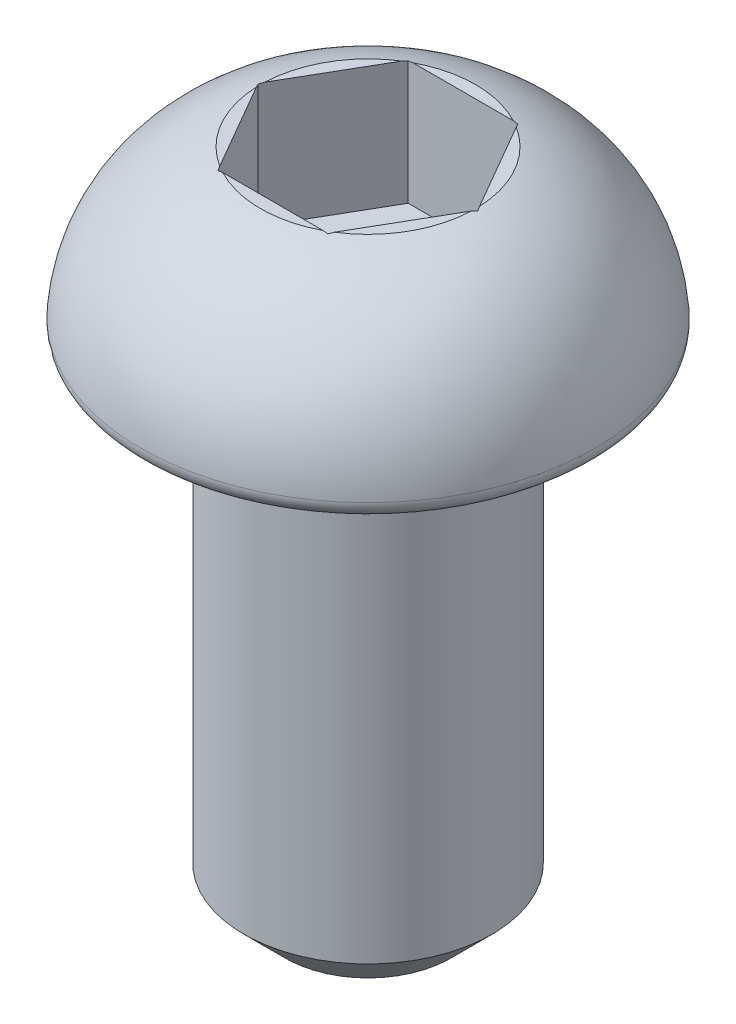
ISO-10303-21;
HEADER;
FILE_DESCRIPTION(('STEP AP214'),'2;1');
FILE_NAME('part.step','',(''),(''),'','','');
FILE_SCHEMA(('AUTOMOTIVE_DESIGN { 1 0 10303 214 1 1 1 1 }'));
ENDSEC;
DATA;
#1=APPLICATION_CONTEXT('core data for automotive mechanical design processes');
#2=APPLICATION_PROTOCOL_DEFINITION('international standard','automotive_design',2000,#1);
#3=PRODUCT_CONTEXT('',#1,'mechanical');
#4=PRODUCT('Part','Part','',(#3));
#5=PRODUCT_RELATED_PRODUCT_CATEGORY('part','',(#4));
#6=PRODUCT_DEFINITION_FORMATION('','',#4);
#7=PRODUCT_DEFINITION_CONTEXT('part definition',#1,'design');
#8=PRODUCT_DEFINITION('design','',#6,#7);
#9=PRODUCT_DEFINITION_SHAPE('','',#8);
#10=(LENGTH_UNIT() NAMED_UNIT(*) SI_UNIT(.MILLI.,.METRE.));
#11=(NAMED_UNIT(*) PLANE_ANGLE_UNIT() SI_UNIT($,.RADIAN.));
#12=(NAMED_UNIT(*) SI_UNIT($,.STERADIAN.) SOLID_ANGLE_UNIT());
#13=UNCERTAINTY_MEASURE_WITH_UNIT(LENGTH_MEASURE(1.E-05),#10,'distance_accuracy_value','');
#14=(GEOMETRIC_REPRESENTATION_CONTEXT(3) GLOBAL_UNCERTAINTY_ASSIGNED_CONTEXT((#13)) GLOBAL_UNIT_ASSIGNED_CONTEXT((#10,
#11,#12)) REPRESENTATION_CONTEXT('',''));
#15=CARTESIAN_POINT('',(0.,0.,0.));
#16=DIRECTION('',(0.,0.,1.));
#17=DIRECTION('',(1.,0.,0.));
#18=AXIS2_PLACEMENT_3D('',#15,#16,#17);
#19=CARTESIAN_POINT('',(0.,0.,0.));
#20=DIRECTION('',(0.,-1.,0.));
#21=DIRECTION('',(0.,0.,-1.));
#22=AXIS2_PLACEMENT_3D('',#19,#20,#21);
#23=PLANE('',#22);
#24=CARTESIAN_POINT('',(0.,0.,0.));
#25=DIRECTION('',(0.,-1.,0.));
#26=DIRECTION('',(0.,0.,-1.));
#27=AXIS2_PLACEMENT_3D('',#24,#25,#26);
#28=CIRCLE('',#27,2.54724235554234);
#29=CARTESIAN_POINT('',(0.,0.,-2.54724235554234));
#30=VERTEX_POINT('',#29);
#31=EDGE_CURVE('E188',#30,#30,#28,.T.);
#32=ORIENTED_EDGE('',*,*,#31,.T.);
#33=EDGE_LOOP('',(#32));
#34=FACE_BOUND('',#33,.T.);
#35=CARTESIAN_POINT('',(0.,0.,0.));
#36=DIRECTION('',(0.,-1.,0.));
#37=DIRECTION('',(0.,0.,-1.));
#38=AXIS2_PLACEMENT_3D('',#35,#36,#37);
#39=CIRCLE('',#38,1.5);
#40=CARTESIAN_POINT('',(0.,0.,-1.5));
#41=VERTEX_POINT('',#40);
#42=EDGE_CURVE('E154',#41,#41,#39,.T.);
#43=ORIENTED_EDGE('',*,*,#42,.F.);
#44=EDGE_LOOP('',(#43));
#45=FACE_BOUND('',#44,.T.);
#46=ADVANCED_FACE('F36',(#34,#45),#23,.T.);
#47=CARTESIAN_POINT('',(0.,2.,0.));
#48=DIRECTION('',(0.,1.,0.));
#49=DIRECTION('',(0.,0.,1.));
#50=AXIS2_PLACEMENT_3D('',#47,#48,#49);
#51=PLANE('',#50);
#52=DIRECTION('',(0.5,0.,-0.866025403784439));
#53=VECTOR('',#52,1.);
#54=CARTESIAN_POINT('',(0.66395280956807,2.,1.15));
#55=LINE('',#54,#53);
#56=CARTESIAN_POINT('',(0.692820323027552,2.,1.1));
#57=VERTEX_POINT('',#56);
#58=CARTESIAN_POINT('',(1.29903810567666,2.,0.0499999999999994));
#59=VERTEX_POINT('',#58);
#60=EDGE_CURVE('E163',#57,#59,#55,.T.);
#61=ORIENTED_EDGE('',*,*,#60,.F.);
#62=CARTESIAN_POINT('',(0.,2.,0.));
#63=DIRECTION('',(0.,-1.,0.));
#64=DIRECTION('',(0.,0.,-1.));
#65=AXIS2_PLACEMENT_3D('',#62,#63,#64);
#66=CIRCLE('',#65,1.3);
#67=EDGE_CURVE('E316',#59,#57,#66,.T.);
#68=ORIENTED_EDGE('',*,*,#67,.F.);
#69=EDGE_LOOP('',(#61,#68));
#70=FACE_BOUND('',#69,.T.);
#71=ADVANCED_FACE('F284',(#70),#51,.T.);
#72=DIRECTION('',(1.,0.,0.));
#73=VECTOR('',#72,1.);
#74=CARTESIAN_POINT('',(-0.66395280956807,2.,1.15));
#75=LINE('',#74,#73);
#76=CARTESIAN_POINT('',(-0.606217782649107,2.,1.15));
#77=VERTEX_POINT('',#76);
#78=CARTESIAN_POINT('',(0.606217782649107,2.,1.15));
#79=VERTEX_POINT('',#78);
#80=EDGE_CURVE('E149',#77,#79,#75,.T.);
#81=ORIENTED_EDGE('',*,*,#80,.F.);
#82=EDGE_CURVE('E318',#79,#77,#66,.T.);
#83=ORIENTED_EDGE('',*,*,#82,.F.);
#84=EDGE_LOOP('',(#81,#83));
#85=FACE_BOUND('',#84,.T.);
#86=ADVANCED_FACE('F290',(#85),#51,.T.);
#87=DIRECTION('',(0.5,0.,0.866025403784438));
#88=VECTOR('',#87,1.);
#89=CARTESIAN_POINT('',(-1.32790561913614,2.,0.));
#90=LINE('',#89,#88);
#91=CARTESIAN_POINT('',(-1.29903810567666,2.,0.0500000000000002));
#92=VERTEX_POINT('',#91);
#93=CARTESIAN_POINT('',(-0.692820323027551,2.,1.1));
#94=VERTEX_POINT('',#93);
#95=EDGE_CURVE('E151',#92,#94,#90,.T.);
#96=ORIENTED_EDGE('',*,*,#95,.F.);
#97=EDGE_CURVE('E320',#94,#92,#66,.T.);
#98=ORIENTED_EDGE('',*,*,#97,.F.);
#99=EDGE_LOOP('',(#96,#98));
#100=FACE_BOUND('',#99,.T.);
#101=ADVANCED_FACE('F344',(#100),#51,.T.);
#102=DIRECTION('',(-0.5,0.,0.866025403784439));
#103=VECTOR('',#102,1.);
#104=CARTESIAN_POINT('',(-0.66395280956807,2.,-1.15));
#105=LINE('',#104,#103);
#106=CARTESIAN_POINT('',(-0.692820323027551,2.,-1.1));
#107=VERTEX_POINT('',#106);
#108=CARTESIAN_POINT('',(-1.29903810567666,2.,-0.0500000000000003));
#109=VERTEX_POINT('',#108);
#110=EDGE_CURVE('E168',#107,#109,#105,.T.);
#111=ORIENTED_EDGE('',*,*,#110,.F.);
#112=EDGE_CURVE('E186',#109,#107,#66,.T.);
#113=ORIENTED_EDGE('',*,*,#112,.F.);
#114=EDGE_LOOP('',(#111,#113));
#115=FACE_BOUND('',#114,.T.);
#116=ADVANCED_FACE('F333',(#115),#51,.T.);
#117=DIRECTION('',(-1.,0.,0.));
#118=VECTOR('',#117,1.);
#119=CARTESIAN_POINT('',(0.663952809568069,2.,-1.15));
#120=LINE('',#119,#118);
#121=CARTESIAN_POINT('',(0.606217782649107,2.,-1.15));
#122=VERTEX_POINT('',#121);
#123=CARTESIAN_POINT('',(-0.606217782649107,2.,-1.15));
#124=VERTEX_POINT('',#123);
#125=EDGE_CURVE('E166',#122,#124,#120,.T.);
#126=ORIENTED_EDGE('',*,*,#125,.F.);
#127=EDGE_CURVE('E173',#124,#122,#66,.T.);
#128=ORIENTED_EDGE('',*,*,#127,.F.);
#129=EDGE_LOOP('',(#126,#128));
#130=FACE_BOUND('',#129,.T.);
#131=ADVANCED_FACE('F309',(#130),#51,.T.);
#132=DIRECTION('',(-0.5,0.,-0.866025403784438));
#133=VECTOR('',#132,1.);
#134=CARTESIAN_POINT('',(1.32790561913614,2.,0.));
#135=LINE('',#134,#133);
#136=CARTESIAN_POINT('',(1.29903810567666,2.,-0.0499999999999994));
#137=VERTEX_POINT('',#136);
#138=CARTESIAN_POINT('',(0.69282032302755,2.,-1.1));
#139=VERTEX_POINT('',#138);
#140=EDGE_CURVE('E51',#137,#139,#135,.T.);
#141=ORIENTED_EDGE('',*,*,#140,.F.);
#142=EDGE_CURVE('E187',#139,#137,#66,.T.);
#143=ORIENTED_EDGE('',*,*,#142,.F.);
#144=EDGE_LOOP('',(#141,#143));
#145=FACE_BOUND('',#144,.T.);
#146=ADVANCED_FACE('F292',(#145),#51,.T.);
#147=CARTESIAN_POINT('',(0.,0.076691427643514,0.));
#148=DIRECTION('',(0.,-1.,0.));
#149=DIRECTION('',(0.,0.,-1.));
#150=AXIS2_PLACEMENT_3D('',#147,#148,#149);
#151=DEGENERATE_TOROIDAL_SURFACE('',#150,0.751470934680709,2.,.T.);
#152=CARTESIAN_POINT('',(0.663837339514232,1.99178669993929,1.1502));
#153=CARTESIAN_POINT('',(0.66878717333089,1.99327644137946,1.14162663634053));
#154=CARTESIAN_POINT('',(0.673740102582228,1.99472242054365,1.13304791123091));
#155=CARTESIAN_POINT('',(0.683652150360132,1.99752685386907,1.11587974087253));
#156=CARTESIAN_POINT('',(0.688611268884708,1.99888530805844,1.10729029562721));
#157=CARTESIAN_POINT('',(0.693573482841972,2.0002,1.0986954889352));
#158=B_SPLINE_CURVE_WITH_KNOTS('',3,(#152,#153,#154,#155,#156,#157),.UNSPECIFIED.,.F.,.F.,(4,2,
4),(0.,0.0300325156416312,0.0600650216231519),.UNSPECIFIED.);
#159=CARTESIAN_POINT('',(0.66395280956807,1.99182146358279,1.15));
#160=VERTEX_POINT('',#159);
#161=EDGE_CURVE('E266',#160,#57,#158,.T.);
#162=ORIENTED_EDGE('',*,*,#161,.F.);
#163=CARTESIAN_POINT('',(0.,2.03658290017349,1.15));
#164=CARTESIAN_POINT('',(0.098646218600147,2.03658732143362,1.15));
#165=CARTESIAN_POINT('',(0.197295101956486,2.03408796152423,1.15));
#166=CARTESIAN_POINT('',(0.394304837949951,2.02310682474313,1.15));
#167=CARTESIAN_POINT('',(0.492665658489158,2.01462440489486,1.15));
#168=CARTESIAN_POINT('',(0.687609728686378,1.98957726871187,1.15));
#169=CARTESIAN_POINT('',(0.784200929312974,1.97307885273518,1.15));
#170=CARTESIAN_POINT('',(0.975057818596466,1.93000622100407,1.15));
#171=CARTESIAN_POINT('',(1.06932598789786,1.90344329758489,1.15));
#172=CARTESIAN_POINT('',(1.27000942224647,1.83324426296719,1.15));
#173=CARTESIAN_POINT('',(1.37568972004873,1.78744372549576,1.15));
#174=CARTESIAN_POINT('',(1.57845042818664,1.67924757225634,1.15));
#175=CARTESIAN_POINT('',(1.67551966120083,1.61683079666585,1.15));
#176=CARTESIAN_POINT('',(1.8578430964694,1.47582375887711,1.15));
#177=CARTESIAN_POINT('',(1.94304549944359,1.39716609459964,1.15));
#178=CARTESIAN_POINT('',(2.09784101718846,1.22574174763031,1.15));
#179=CARTESIAN_POINT('',(2.16743940990664,1.13297985346576,1.15));
#180=CARTESIAN_POINT('',(2.28431419983866,0.94263887552125,1.15));
#181=CARTESIAN_POINT('',(2.33275383814089,0.845772961604736,1.15));
#182=CARTESIAN_POINT('',(2.41188684890319,0.645049587695764,1.15));
#183=CARTESIAN_POINT('',(2.44258507109003,0.541194047036149,1.15));
#184=CARTESIAN_POINT('',(2.48427081779776,0.334046404725987,1.15));
#185=CARTESIAN_POINT('',(2.49601517014892,0.230905918770504,1.15));
#186=CARTESIAN_POINT('',(2.50179966751879,0.0241281883602649,1.15));
#187=CARTESIAN_POINT('',(2.49584075628937,-0.0795090293199227,1.15));
#188=CARTESIAN_POINT('',(2.46658780707738,-0.283077440217687,1.15));
#189=CARTESIAN_POINT('',(2.44349452160948,-0.383037592772008,1.15));
#190=CARTESIAN_POINT('',(2.38096161026423,-0.577676291567684,1.15));
#191=CARTESIAN_POINT('',(2.34152541798826,-0.672355942490544,1.15));
#192=CARTESIAN_POINT('',(2.24727327907491,-0.854473591721951,1.15));
#193=CARTESIAN_POINT('',(2.19236137755517,-0.941861853863798,1.15));
#194=CARTESIAN_POINT('',(2.06898309304621,-1.10654284237712,1.15));
#195=CARTESIAN_POINT('',(2.00050758110401,-1.18382871088677,1.15));
#196=CARTESIAN_POINT('',(1.85001098526993,-1.32858936571327,1.15));
#197=CARTESIAN_POINT('',(1.76765450591879,-1.3957143916501,1.15));
#198=CARTESIAN_POINT('',(1.59361449911652,-1.51612024156412,1.15));
#199=CARTESIAN_POINT('',(1.50194689329583,-1.56942416234802,1.15));
#200=CARTESIAN_POINT('',(1.3442167468046,-1.64633505265362,1.15));
#201=CARTESIAN_POINT('',(1.28002488900966,-1.67388067349761,1.15));
#202=CARTESIAN_POINT('',(1.14942569560088,-1.72309655156327,1.15));
#203=CARTESIAN_POINT('',(1.08301829059227,-1.74476662455823,1.15));
#204=CARTESIAN_POINT('',(0.948299721594118,-1.78271208504272,1.15));
#205=CARTESIAN_POINT('',(0.879979992399287,-1.79895664735316,1.15));
#206=CARTESIAN_POINT('',(0.742372225887791,-1.82648676897236,1.15));
#207=CARTESIAN_POINT('',(0.673084213384437,-1.83777245511816,1.15));
#208=CARTESIAN_POINT('',(0.491428640373657,-1.8618030535964,1.15));
#209=CARTESIAN_POINT('',(0.378625107961637,-1.87122074908676,1.15));
#210=CARTESIAN_POINT('',(0.209143758579499,-1.87958699044929,1.15));
#211=CARTESIAN_POINT('',(0.152562345228347,-1.88141490888953,1.15));
#212=CARTESIAN_POINT('',(0.0393669602172776,-1.88335114487218,1.15));
#213=CARTESIAN_POINT('',(-0.0172470100143041,-1.883459532838,1.15));
#214=CARTESIAN_POINT('',(-0.130350030932136,-1.88197557574409,1.15));
#215=CARTESIAN_POINT('',(-0.186839119823327,-1.88038635915171,1.15));
#216=CARTESIAN_POINT('',(-0.299728920798325,-1.87531771771226,1.15));
#217=CARTESIAN_POINT('',(-0.356129628836693,-1.87183820873768,1.15));
#218=CARTESIAN_POINT('',(-0.524916952582429,-1.85805049067533,1.15));
#219=CARTESIAN_POINT('',(-0.637092371817397,-1.84439266677423,1.15));
#220=CARTESIAN_POINT('',(-0.810017493876797,-1.81361696288777,1.15));
#221=CARTESIAN_POINT('',(-0.871521077506692,-1.80071656706703,1.15));
#222=CARTESIAN_POINT('',(-0.993496408589721,-1.77064052799502,1.15));
#223=CARTESIAN_POINT('',(-1.05396806098029,-1.75346449311514,1.15));
#224=CARTESIAN_POINT('',(-1.17323439190626,-1.71454198802947,1.15));
#225=CARTESIAN_POINT('',(-1.2320335047974,-1.69280919801169,1.15));
#226=CARTESIAN_POINT('',(-1.34764514507638,-1.64452542038476,1.15));
#227=CARTESIAN_POINT('',(-1.40445721463237,-1.61797333097724,1.15));
#228=CARTESIAN_POINT('',(-1.51607405614635,-1.55969669663654,1.15));
#229=CARTESIAN_POINT('',(-1.57085410804412,-1.52792462132762,1.15));
#230=CARTESIAN_POINT('',(-1.67726545993891,-1.45943403628238,1.15));
#231=CARTESIAN_POINT('',(-1.72889554802264,-1.42271363995312,1.15));
#232=CARTESIAN_POINT('',(-1.82847105838098,-1.34445894230347,1.15));
#233=CARTESIAN_POINT('',(-1.87641252573548,-1.30291959053453,1.15));
#234=CARTESIAN_POINT('',(-1.9680035552563,-1.21534492943057,1.15));
#235=CARTESIAN_POINT('',(-2.01165174969555,-1.16930819659477,1.15));
#236=CARTESIAN_POINT('',(-2.12614975655006,-1.03572622565891,1.15));
#237=CARTESIAN_POINT('',(-2.19186050387076,-0.943665750390142,1.15));
#238=CARTESIAN_POINT('',(-2.30546191326039,-0.749288259753581,1.15));
#239=CARTESIAN_POINT('',(-2.35337031200657,-0.646981582540756,1.15));
#240=CARTESIAN_POINT('',(-2.42703869947872,-0.442585671523526,1.15));
#241=CARTESIAN_POINT('',(-2.45409068083514,-0.340961259178402,1.15));
#242=CARTESIAN_POINT('',(-2.49032992545249,-0.134567326214733,1.15));
#243=CARTESIAN_POINT('',(-2.49951787124879,-0.0297979259127926,1.15));
#244=CARTESIAN_POINT('',(-2.49971519023315,0.177457556639515,1.15));
#245=CARTESIAN_POINT('',(-2.49111740474565,0.279943506757529,1.15));
#246=CARTESIAN_POINT('',(-2.45681698932696,0.482000924000085,1.15));
#247=CARTESIAN_POINT('',(-2.43111591392285,0.581572655140941,1.15));
#248=CARTESIAN_POINT('',(-2.36347334234934,0.774935615001325,1.15));
#249=CARTESIAN_POINT('',(-2.32154526289618,0.868731545166596,1.15));
#250=CARTESIAN_POINT('',(-2.22279701257776,1.04811167401887,1.15));
#251=CARTESIAN_POINT('',(-2.16597630912103,1.13369557887707,1.15));
#252=CARTESIAN_POINT('',(-2.03810854833738,1.29594922041055,1.15));
#253=CARTESIAN_POINT('',(-1.96682676359936,1.37243365695663,1.15));
#254=CARTESIAN_POINT('',(-1.81295905623226,1.51300240336353,1.15));
#255=CARTESIAN_POINT('',(-1.73037090646585,1.57708426413665,1.15));
#256=CARTESIAN_POINT('',(-1.5520613820707,1.69471516717586,1.15));
#257=CARTESIAN_POINT('',(-1.45589046579648,1.74757961403836,1.15));
#258=CARTESIAN_POINT('',(-1.25692243260643,1.83837035879711,1.15));
#259=CARTESIAN_POINT('',(-1.15413109373742,1.87630948273586,1.15));
#260=CARTESIAN_POINT('',(-0.964938329481516,1.93242013134816,1.15));
#261=CARTESIAN_POINT('',(-0.879225780531216,1.95299866436732,1.15));
#262=CARTESIAN_POINT('',(-0.706280939870257,1.98646029403696,1.15));
#263=CARTESIAN_POINT('',(-0.6190475593282,1.9993376228744,1.15));
#264=CARTESIAN_POINT('',(-0.443289273005161,2.01901301040914,1.15));
#265=CARTESIAN_POINT('',(-0.354759586940948,2.02576557714995,1.15));
#266=CARTESIAN_POINT('',(-0.17748732142704,2.03454856601354,1.15));
#267=CARTESIAN_POINT('',(-0.0887447390438819,2.03657892269132,1.15));
#268=CARTESIAN_POINT('',(0.,2.03658290017349,1.15));
#269=B_SPLINE_CURVE_WITH_KNOTS('',3,(#163,#164,#165,#166,#167,#168,#169,#170,#171,#172,#173,
#174,#175,#176,#177,#178,#179,#180,#181,#182,#183,#184,#185,#186,#187,#188,#189,#190,#191,#192,
#193,#194,#195,#196,#197,#198,#199,#200,#201,#202,#203,#204,#205,#206,#207,#208,#209,#210,#211,
#212,#213,#214,#215,#216,#217,#218,#219,#220,#221,#222,#223,#224,#225,#226,#227,#228,#229,#230,
#231,#232,#233,#234,#235,#236,#237,#238,#239,#240,#241,#242,#243,#244,#245,#246,#247,#248,#249,
#250,#251,#252,#253,#254,#255,#256,#257,#258,#259,#260,#261,#262,#263,#264,#265,#266,#267,#268),
.UNSPECIFIED.,.T.,.F.,(4,2,2,2,2,2,2,2,2,2,2,2,2,2,2,2,2,2,2,2,2,2,2,2,2,2,2,2,2,2,2,2,2,2,2,2,
2,2,2,2,2,2,2,2,2,2,2,2,2,2,2,2,4),(0.,0.295902440396797,0.591836685142885,0.88536388192649,
1.1785627130153,1.52269996813138,1.86727757612131,2.21331506104864,2.5592353240376,
2.88250449229488,3.2056852510601,3.51561009227793,3.82551841185847,4.13185195746594,
4.43812117581053,4.74633280791623,5.05475259026988,5.37212175852073,5.68895709402482,
5.89824437929793,6.10753822597639,6.31800171851667,6.52845982755554,6.86760372007158,
7.03742508416335,7.20723949320035,7.37674149510497,7.54625104131724,7.8846605033158,
8.07306010337971,8.26147696632307,8.44933606655962,8.63723816976182,8.82695710833894,
9.01674858473973,9.20674079803173,9.39679334327464,9.73415597564318,10.0711815829047,
10.3851290507443,10.6990645232839,11.0061400458043,11.3131876618792,11.6199819471461,
11.9267872055172,12.2390410643218,12.5513565198947,12.8792462443636,13.2068535787986,
13.4709069754266,13.7351578878529,14.0013558354432,14.267557472243),.UNSPECIFIED.);
#270=EDGE_CURVE('E59',#79,#160,#269,.T.);
#271=ORIENTED_EDGE('',*,*,#270,.F.);
#272=ORIENTED_EDGE('',*,*,#82,.T.);
#273=CARTESIAN_POINT('',(-0.66395280956807,1.99182146358212,1.15));
#274=VERTEX_POINT('',#273);
#275=EDGE_CURVE('E262',#274,#77,#269,.T.);
#276=ORIENTED_EDGE('',*,*,#275,.F.);
#277=CARTESIAN_POINT('',(-0.693573482841972,2.0002,1.0986954889352));
#278=CARTESIAN_POINT('',(-0.688611268884708,1.99888530805844,1.10729029562721));
#279=CARTESIAN_POINT('',(-0.683652150360132,1.99752685386907,1.11587974087253));
#280=CARTESIAN_POINT('',(-0.673740102582228,1.99472242054365,1.13304791123091));
#281=CARTESIAN_POINT('',(-0.66878717333089,1.99327644137946,1.14162663634053));
#282=CARTESIAN_POINT('',(-0.663837339514232,1.99178669993929,1.1502));
#283=B_SPLINE_CURVE_WITH_KNOTS('',3,(#277,#278,#279,#280,#281,#282),.UNSPECIFIED.,.F.,.F.,(4,2,
4),(0.,0.0300325059815209,0.0600650216231522),.UNSPECIFIED.);
#284=EDGE_CURVE('E257',#94,#274,#283,.T.);
#285=ORIENTED_EDGE('',*,*,#284,.F.);
#286=ORIENTED_EDGE('',*,*,#97,.T.);
#287=CARTESIAN_POINT('',(-1.32802108918998,1.99178669993929,-0.000199999999999881));
#288=CARTESIAN_POINT('',(-1.32307125537332,1.99327644137946,0.00837336365947469));
#289=CARTESIAN_POINT('',(-1.31811832612198,1.99472242054365,0.0169520887690861));
#290=CARTESIAN_POINT('',(-1.30820627834408,1.99752685386907,0.0341202591274678));
#291=CARTESIAN_POINT('',(-1.3032471598195,1.99888530805844,0.0427097043727891));
#292=CARTESIAN_POINT('',(-1.29828494586224,2.0002,0.0513045110647981));
#293=B_SPLINE_CURVE_WITH_KNOTS('',3,(#287,#288,#289,#290,#291,#292),.UNSPECIFIED.,.F.,.F.,(4,2,
4),(0.,0.030032515641632,0.0600650216231535),.UNSPECIFIED.);
#294=CARTESIAN_POINT('',(-1.32790561913614,1.99182146358212,0.));
#295=VERTEX_POINT('',#294);
#296=EDGE_CURVE('E252',#295,#92,#293,.T.);
#297=ORIENTED_EDGE('',*,*,#296,.F.);
#298=CARTESIAN_POINT('',(-1.29828494586224,2.0002,-0.0513045110647978));
#299=CARTESIAN_POINT('',(-1.3032471598195,1.99888530805844,-0.0427097043727888));
#300=CARTESIAN_POINT('',(-1.30820627834408,1.99752685386907,-0.0341202591274676));
#301=CARTESIAN_POINT('',(-1.31811832612198,1.99472242054365,-0.016952088769086));
#302=CARTESIAN_POINT('',(-1.32307125537332,1.99327644137946,-0.00837336365947457));
#303=CARTESIAN_POINT('',(-1.32802108918998,1.99178669993929,0.000199999999999972));
#304=B_SPLINE_CURVE_WITH_KNOTS('',3,(#298,#299,#300,#301,#302,#303),.UNSPECIFIED.,.F.,.F.,(4,2,
4),(0.,0.0300325059815215,0.0600650216231534),.UNSPECIFIED.);
#305=EDGE_CURVE('E232',#109,#295,#304,.T.);
#306=ORIENTED_EDGE('',*,*,#305,.F.);
#307=ORIENTED_EDGE('',*,*,#112,.T.);
#308=CARTESIAN_POINT('',(-0.663837339514232,1.99178669993929,-1.1502));
#309=CARTESIAN_POINT('',(-0.66878717333089,1.99327644137946,-1.14162663634053));
#310=CARTESIAN_POINT('',(-0.673740102582228,1.99472242054365,-1.13304791123091));
#311=CARTESIAN_POINT('',(-0.683652150360133,1.99752685386907,-1.11587974087253));
#312=CARTESIAN_POINT('',(-0.688611268884709,1.99888530805844,-1.10729029562721));
#313=CARTESIAN_POINT('',(-0.693573482841973,2.0002,-1.0986954889352));
#314=B_SPLINE_CURVE_WITH_KNOTS('',3,(#308,#309,#310,#311,#312,#313),.UNSPECIFIED.,.F.,.F.,(4,2,
4),(0.,0.0300325156416316,0.0600650216231527),.UNSPECIFIED.);
#315=CARTESIAN_POINT('',(-0.66395280956807,1.99182146358279,-1.15));
#316=VERTEX_POINT('',#315);
#317=EDGE_CURVE('E227',#316,#107,#314,.T.);
#318=ORIENTED_EDGE('',*,*,#317,.F.);
#319=CARTESIAN_POINT('',(0.,2.03658290017349,-1.15));
#320=CARTESIAN_POINT('',(-0.0986462186001475,2.03658732143362,-1.15));
#321=CARTESIAN_POINT('',(-0.197295101956487,2.03408796152423,-1.15));
#322=CARTESIAN_POINT('',(-0.394304837949951,2.02310682474313,-1.15));
#323=CARTESIAN_POINT('',(-0.492665658489158,2.01462440489486,-1.15));
#324=CARTESIAN_POINT('',(-0.687609728686379,1.98957726871187,-1.15));
#325=CARTESIAN_POINT('',(-0.784200929312975,1.97307885273518,-1.15));
#326=CARTESIAN_POINT('',(-0.975057818596467,1.93000622100407,-1.15));
#327=CARTESIAN_POINT('',(-1.06932598789786,1.90344329758489,-1.15));
#328=CARTESIAN_POINT('',(-1.27000942224647,1.83324426296719,-1.15));
#329=CARTESIAN_POINT('',(-1.37568972004873,1.78744372549576,-1.15));
#330=CARTESIAN_POINT('',(-1.57845042818664,1.67924757225634,-1.15));
#331=CARTESIAN_POINT('',(-1.67551966120083,1.61683079666585,-1.15));
#332=CARTESIAN_POINT('',(-1.8578430964694,1.47582375887711,-1.15));
#333=CARTESIAN_POINT('',(-1.94304549944359,1.39716609459964,-1.15));
#334=CARTESIAN_POINT('',(-2.09784101718846,1.22574174763031,-1.15));
#335=CARTESIAN_POINT('',(-2.16743940990664,1.13297985346576,-1.15));
#336=CARTESIAN_POINT('',(-2.28431419983867,0.942638875521249,-1.15));
#337=CARTESIAN_POINT('',(-2.33275383814089,0.845772961604735,-1.15));
#338=CARTESIAN_POINT('',(-2.41188684890319,0.645049587695763,-1.15));
#339=CARTESIAN_POINT('',(-2.44258507109003,0.541194047036148,-1.15));
#340=CARTESIAN_POINT('',(-2.48427081779776,0.334046404725987,-1.15));
#341=CARTESIAN_POINT('',(-2.49601517014892,0.230905918770504,-1.15));
#342=CARTESIAN_POINT('',(-2.50179966751879,0.0241281883602644,-1.15));
#343=CARTESIAN_POINT('',(-2.49584075628937,-0.0795090293199232,-1.15));
#344=CARTESIAN_POINT('',(-2.46658780707738,-0.283077440217688,-1.15));
#345=CARTESIAN_POINT('',(-2.44349452160948,-0.383037592772009,-1.15));
#346=CARTESIAN_POINT('',(-2.38096161026423,-0.577676291567685,-1.15));
#347=CARTESIAN_POINT('',(-2.34152541798826,-0.672355942490545,-1.15));
#348=CARTESIAN_POINT('',(-2.24727327907491,-0.854473591721952,-1.15));
#349=CARTESIAN_POINT('',(-2.19236137755517,-0.941861853863799,-1.15));
#350=CARTESIAN_POINT('',(-2.06898309304621,-1.10654284237712,-1.15));
#351=CARTESIAN_POINT('',(-2.00050758110401,-1.18382871088677,-1.15));
#352=CARTESIAN_POINT('',(-1.85001098526993,-1.32858936571327,-1.15));
#353=CARTESIAN_POINT('',(-1.76765450591879,-1.3957143916501,-1.15));
#354=CARTESIAN_POINT('',(-1.59361449911652,-1.51612024156412,-1.15));
#355=CARTESIAN_POINT('',(-1.50194689329583,-1.56942416234802,-1.15));
#356=CARTESIAN_POINT('',(-1.3442167468046,-1.64633505265362,-1.15));
#357=CARTESIAN_POINT('',(-1.28002488900966,-1.67388067349761,-1.15));
#358=CARTESIAN_POINT('',(-1.14942569560088,-1.72309655156327,-1.15));
#359=CARTESIAN_POINT('',(-1.08301829059227,-1.74476662455823,-1.15));
#360=CARTESIAN_POINT('',(-0.948299721594117,-1.78271208504273,-1.15));
#361=CARTESIAN_POINT('',(-0.879979992399286,-1.79895664735316,-1.15));
#362=CARTESIAN_POINT('',(-0.74237222588779,-1.82648676897236,-1.15));
#363=CARTESIAN_POINT('',(-0.673084213384436,-1.83777245511816,-1.15));
#364=CARTESIAN_POINT('',(-0.491428640373656,-1.8618030535964,-1.15));
#365=CARTESIAN_POINT('',(-0.378625107961636,-1.87122074908676,-1.15));
#366=CARTESIAN_POINT('',(-0.209143758579498,-1.87958699044929,-1.15));
#367=CARTESIAN_POINT('',(-0.152562345228346,-1.88141490888953,-1.15));
#368=CARTESIAN_POINT('',(-0.0393669602172767,-1.88335114487218,-1.15));
#369=CARTESIAN_POINT('',(0.0172470100143049,-1.883459532838,-1.15));
#370=CARTESIAN_POINT('',(0.130350030932137,-1.88197557574409,-1.15));
#371=CARTESIAN_POINT('',(0.186839119823328,-1.88038635915171,-1.15));
#372=CARTESIAN_POINT('',(0.299728920798326,-1.87531771771226,-1.15));
#373=CARTESIAN_POINT('',(0.356129628836694,-1.87183820873768,-1.15));
#374=CARTESIAN_POINT('',(0.524916952582429,-1.85805049067533,-1.15));
#375=CARTESIAN_POINT('',(0.637092371817398,-1.84439266677423,-1.15));
#376=CARTESIAN_POINT('',(0.810017493876798,-1.81361696288777,-1.15));
#377=CARTESIAN_POINT('',(0.871521077506693,-1.80071656706703,-1.15));
#378=CARTESIAN_POINT('',(0.993496408589723,-1.77064052799502,-1.15));
#379=CARTESIAN_POINT('',(1.05396806098029,-1.75346449311514,-1.15));
#380=CARTESIAN_POINT('',(1.17323439190626,-1.71454198802947,-1.15));
#381=CARTESIAN_POINT('',(1.2320335047974,-1.69280919801169,-1.15));
#382=CARTESIAN_POINT('',(1.34764514507638,-1.64452542038476,-1.15));
#383=CARTESIAN_POINT('',(1.40445721463237,-1.61797333097724,-1.15));
#384=CARTESIAN_POINT('',(1.51607405614635,-1.55969669663654,-1.15));
#385=CARTESIAN_POINT('',(1.57085410804412,-1.52792462132762,-1.15));
#386=CARTESIAN_POINT('',(1.67726545993891,-1.45943403628238,-1.15));
#387=CARTESIAN_POINT('',(1.72889554802264,-1.42271363995312,-1.15));
#388=CARTESIAN_POINT('',(1.82847105838098,-1.34445894230347,-1.15));
#389=CARTESIAN_POINT('',(1.87641252573548,-1.30291959053453,-1.15));
#390=CARTESIAN_POINT('',(1.9680035552563,-1.21534492943057,-1.15));
#391=CARTESIAN_POINT('',(2.01165174969555,-1.16930819659477,-1.15));
#392=CARTESIAN_POINT('',(2.12614975655006,-1.03572622565891,-1.15));
#393=CARTESIAN_POINT('',(2.19186050387076,-0.943665750390142,-1.15));
#394=CARTESIAN_POINT('',(2.30546191326039,-0.749288259753581,-1.15));
#395=CARTESIAN_POINT('',(2.35337031200657,-0.646981582540756,-1.15));
#396=CARTESIAN_POINT('',(2.42703869947872,-0.442585671523526,-1.15));
#397=CARTESIAN_POINT('',(2.45409068083514,-0.340961259178402,-1.15));
#398=CARTESIAN_POINT('',(2.49032992545249,-0.134567326214733,-1.15));
#399=CARTESIAN_POINT('',(2.49951787124879,-0.0297979259127928,-1.15));
#400=CARTESIAN_POINT('',(2.49971519023315,0.177457556639515,-1.15));
#401=CARTESIAN_POINT('',(2.49111740474565,0.279943506757529,-1.15));
#402=CARTESIAN_POINT('',(2.45681698932696,0.482000924000085,-1.15));
#403=CARTESIAN_POINT('',(2.43111591392285,0.581572655140941,-1.15));
#404=CARTESIAN_POINT('',(2.36347334234934,0.774935615001325,-1.15));
#405=CARTESIAN_POINT('',(2.32154526289618,0.868731545166596,-1.15));
#406=CARTESIAN_POINT('',(2.22279701257776,1.04811167401887,-1.15));
#407=CARTESIAN_POINT('',(2.16597630912103,1.13369557887707,-1.15));
#408=CARTESIAN_POINT('',(2.03810854833738,1.29594922041055,-1.15));
#409=CARTESIAN_POINT('',(1.96682676359936,1.37243365695663,-1.15));
#410=CARTESIAN_POINT('',(1.81295905623226,1.51300240336353,-1.15));
#411=CARTESIAN_POINT('',(1.73037090646585,1.57708426413665,-1.15));
#412=CARTESIAN_POINT('',(1.5520613820707,1.69471516717586,-1.15));
#413=CARTESIAN_POINT('',(1.45589046579648,1.74757961403836,-1.15));
#414=CARTESIAN_POINT('',(1.25692243260643,1.83837035879711,-1.15));
#415=CARTESIAN_POINT('',(1.15413109373742,1.87630948273586,-1.15));
#416=CARTESIAN_POINT('',(0.964938329481515,1.93242013134816,-1.15));
#417=CARTESIAN_POINT('',(0.879225780531215,1.95299866436732,-1.15));
#418=CARTESIAN_POINT('',(0.706280939870256,1.98646029403696,-1.15));
#419=CARTESIAN_POINT('',(0.619047559328199,1.9993376228744,-1.15));
#420=CARTESIAN_POINT('',(0.44328927300516,2.01901301040914,-1.15));
#421=CARTESIAN_POINT('',(0.354759586940947,2.02576557714995,-1.15));
#422=CARTESIAN_POINT('',(0.17748732142704,2.03454856601354,-1.15));
#423=CARTESIAN_POINT('',(0.0887447390438815,2.03657892269132,-1.15));
#424=CARTESIAN_POINT('',(0.,2.03658290017349,-1.15));
#425=B_SPLINE_CURVE_WITH_KNOTS('',3,(#319,#320,#321,#322,#323,#324,#325,#326,#327,#328,#329,
#330,#331,#332,#333,#334,#335,#336,#337,#338,#339,#340,#341,#342,#343,#344,#345,#346,#347,#348,
#349,#350,#351,#352,#353,#354,#355,#356,#357,#358,#359,#360,#361,#362,#363,#364,#365,#366,#367,
#368,#369,#370,#371,#372,#373,#374,#375,#376,#377,#378,#379,#380,#381,#382,#383,#384,#385,#386,
#387,#388,#389,#390,#391,#392,#393,#394,#395,#396,#397,#398,#399,#400,#401,#402,#403,#404,#405,
#406,#407,#408,#409,#410,#411,#412,#413,#414,#415,#416,#417,#418,#419,#420,#421,#422,#423,#424),
.UNSPECIFIED.,.T.,.F.,(4,2,2,2,2,2,2,2,2,2,2,2,2,2,2,2,2,2,2,2,2,2,2,2,2,2,2,2,2,2,2,2,2,2,2,2,
2,2,2,2,2,2,2,2,2,2,2,2,2,2,2,2,4),(0.,0.295902440396797,0.591836685142885,0.88536388192649,
1.1785627130153,1.52269996813138,1.86727757612131,2.21331506104864,2.5592353240376,
2.88250449229488,3.2056852510601,3.51561009227793,3.82551841185847,4.13185195746594,
4.43812117581053,4.74633280791623,5.05475259026988,5.37212175852073,5.68895709402482,
5.89824437929793,6.10753822597639,6.31800171851667,6.52845982755554,6.86760372007158,
7.03742508416334,7.20723949320035,7.37674149510497,7.54625104131724,7.8846605033158,
8.07306010337971,8.26147696632306,8.44933606655962,8.63723816976182,8.82695710833893,
9.01674858473973,9.20674079803173,9.39679334327464,9.73415597564318,10.0711815829047,
10.3851290507443,10.6990645232839,11.0061400458043,11.3131876618792,11.6199819471461,
11.9267872055172,12.2390410643218,12.5513565198947,12.8792462443636,13.2068535787986,
13.4709069754266,13.7351578878529,14.0013558354432,14.2675574722429),.UNSPECIFIED.);
#426=EDGE_CURVE('E226',#124,#316,#425,.T.);
#427=ORIENTED_EDGE('',*,*,#426,.F.);
#428=ORIENTED_EDGE('',*,*,#127,.T.);
#429=CARTESIAN_POINT('',(0.663952809568069,1.99182146358212,-1.15));
#430=VERTEX_POINT('',#429);
#431=EDGE_CURVE('E201',#430,#122,#425,.T.);
#432=ORIENTED_EDGE('',*,*,#431,.F.);
#433=CARTESIAN_POINT('',(0.693573482841971,2.0002,-1.0986954889352));
#434=CARTESIAN_POINT('',(0.688611268884707,1.99888530805844,-1.10729029562721));
#435=CARTESIAN_POINT('',(0.683652150360131,1.99752685386907,-1.11587974087253));
#436=CARTESIAN_POINT('',(0.673740102582227,1.99472242054365,-1.13304791123091));
#437=CARTESIAN_POINT('',(0.668787173330889,1.99327644137946,-1.14162663634053));
#438=CARTESIAN_POINT('',(0.663837339514231,1.99178669993929,-1.1502));
#439=B_SPLINE_CURVE_WITH_KNOTS('',3,(#433,#434,#435,#436,#437,#438),.UNSPECIFIED.,.F.,.F.,(4,2,
4),(0.,0.0300325059815199,0.0600650216231502),.UNSPECIFIED.);
#440=EDGE_CURVE('E194',#139,#430,#439,.T.);
#441=ORIENTED_EDGE('',*,*,#440,.F.);
#442=ORIENTED_EDGE('',*,*,#142,.T.);
#443=CARTESIAN_POINT('',(1.32802108918998,1.99178669993929,0.000199999999999741));
#444=CARTESIAN_POINT('',(1.32307125537332,1.99327644137946,-0.00837336365947432));
#445=CARTESIAN_POINT('',(1.31811832612198,1.99472242054365,-0.0169520887690852));
#446=CARTESIAN_POINT('',(1.30820627834408,1.99752685386907,-0.034120259127466));
#447=CARTESIAN_POINT('',(1.3032471598195,1.99888530805844,-0.0427097043727867));
#448=CARTESIAN_POINT('',(1.29828494586224,2.0002,-0.0513045110647953));
#449=B_SPLINE_CURVE_WITH_KNOTS('',3,(#443,#444,#445,#446,#447,#448),.UNSPECIFIED.,.F.,.F.,(4,2,
4),(0.,0.0300325156416303,0.0600650216231501),.UNSPECIFIED.);
#450=CARTESIAN_POINT('',(1.32790561913614,1.99182146358279,0.));
#451=VERTEX_POINT('',#450);
#452=EDGE_CURVE('E217',#451,#137,#449,.T.);
#453=ORIENTED_EDGE('',*,*,#452,.F.);
#454=CARTESIAN_POINT('',(1.29828494586224,2.0002,0.0513045110647961));
#455=CARTESIAN_POINT('',(1.3032471598195,1.99888530805844,0.0427097043727873));
#456=CARTESIAN_POINT('',(1.30820627834408,1.99752685386907,0.0341202591274664));
#457=CARTESIAN_POINT('',(1.31811832612198,1.99472242054365,0.0169520887690852));
#458=CARTESIAN_POINT('',(1.32307125537332,1.99327644137946,0.00837336365947403));
#459=CARTESIAN_POINT('',(1.32802108918998,1.99178669993929,-0.00020000000000029));
#460=B_SPLINE_CURVE_WITH_KNOTS('',3,(#454,#455,#456,#457,#458,#459),.UNSPECIFIED.,.F.,.F.,(4,2,
4),(0.,0.0300325059815206,0.0600650216231517),.UNSPECIFIED.);
#461=EDGE_CURVE('E132',#59,#451,#460,.T.);
#462=ORIENTED_EDGE('',*,*,#461,.F.);
#463=ORIENTED_EDGE('',*,*,#67,.T.);
#464=EDGE_LOOP('',(#162,#271,#272,#276,#285,#286,#297,#306,#307,#318,#427,#428,#432,#441,#442,
#453,#462,#463));
#465=FACE_BOUND('',#464,.T.);
#466=CARTESIAN_POINT('',(0.,0.213700952484054,0.));
#467=DIRECTION('',(0.,-1.,0.));
#468=DIRECTION('',(0.,0.,-1.));
#469=AXIS2_PLACEMENT_3D('',#466,#467,#468);
#470=CIRCLE('',#469,2.74677251341586);
#471=CARTESIAN_POINT('',(0.,0.213700952484054,-2.74677251341586));
#472=VERTEX_POINT('',#471);
#473=EDGE_CURVE('E191',#472,#472,#470,.F.);
#474=ORIENTED_EDGE('',*,*,#473,.T.);
#475=EDGE_LOOP('',(#474));
#476=FACE_BOUND('',#475,.T.);
#477=ADVANCED_FACE('F206',(#465,#476),#151,.T.);
#478=CARTESIAN_POINT('',(0.,0.2,0.));
#479=DIRECTION('',(0.,-1.,0.));
#480=DIRECTION('',(0.,0.,-1.));
#481=AXIS2_PLACEMENT_3D('',#478,#479,#480);
#482=TOROIDAL_SURFACE('',#481,2.54724235554234,0.2);
#483=ORIENTED_EDGE('',*,*,#473,.F.);
#484=EDGE_LOOP('',(#483));
#485=FACE_BOUND('',#484,.T.);
#486=ORIENTED_EDGE('',*,*,#31,.F.);
#487=EDGE_LOOP('',(#486));
#488=FACE_BOUND('',#487,.T.);
#489=ADVANCED_FACE('F294',(#485,#488),#482,.T.);
#490=CARTESIAN_POINT('',(0.66395280956807,0.5,1.15));
#491=DIRECTION('',(0.866025403784439,0.,0.499999999999999));
#492=DIRECTION('',(0.5,0.,-0.866025403784439));
#493=AXIS2_PLACEMENT_3D('',#490,#491,#492);
#494=PLANE('',#493);
#495=ORIENTED_EDGE('',*,*,#161,.T.);
#496=ORIENTED_EDGE('',*,*,#60,.T.);
#497=ORIENTED_EDGE('',*,*,#461,.T.);
#498=DIRECTION('',(0.,1.,0.));
#499=VECTOR('',#498,1.);
#500=CARTESIAN_POINT('',(1.32790561913614,0.5,0.));
#501=LINE('',#500,#499);
#502=CARTESIAN_POINT('',(1.32790561913614,0.5,0.));
#503=VERTEX_POINT('',#502);
#504=EDGE_CURVE('E125',#503,#451,#501,.T.);
#505=ORIENTED_EDGE('',*,*,#504,.F.);
#506=DIRECTION('',(0.5,0.,-0.866025403784439));
#507=VECTOR('',#506,1.);
#508=CARTESIAN_POINT('',(0.66395280956807,0.5,1.15));
#509=LINE('',#508,#507);
#510=CARTESIAN_POINT('',(0.66395280956807,0.5,1.15));
#511=VERTEX_POINT('',#510);
#512=EDGE_CURVE('E129',#511,#503,#509,.T.);
#513=ORIENTED_EDGE('',*,*,#512,.F.);
#514=DIRECTION('',(0.,1.,0.));
#515=VECTOR('',#514,1.);
#516=CARTESIAN_POINT('',(0.66395280956807,0.5,1.15));
#517=LINE('',#516,#515);
#518=EDGE_CURVE('E171',#511,#160,#517,.T.);
#519=ORIENTED_EDGE('',*,*,#518,.T.);
#520=EDGE_LOOP('',(#495,#496,#497,#505,#513,#519));
#521=FACE_BOUND('',#520,.T.);
#522=ADVANCED_FACE('F127',(#521),#494,.F.);
#523=CARTESIAN_POINT('',(-0.66395280956807,0.5,1.15));
#524=DIRECTION('',(0.,0.,1.));
#525=DIRECTION('',(1.,0.,0.));
#526=AXIS2_PLACEMENT_3D('',#523,#524,#525);
#527=PLANE('',#526);
#528=ORIENTED_EDGE('',*,*,#270,.T.);
#529=ORIENTED_EDGE('',*,*,#518,.F.);
#530=DIRECTION('',(1.,0.,0.));
#531=VECTOR('',#530,1.);
#532=CARTESIAN_POINT('',(-0.66395280956807,0.5,1.15));
#533=LINE('',#532,#531);
#534=CARTESIAN_POINT('',(-0.66395280956807,0.5,1.15));
#535=VERTEX_POINT('',#534);
#536=EDGE_CURVE('E135',#535,#511,#533,.T.);
#537=ORIENTED_EDGE('',*,*,#536,.F.);
#538=DIRECTION('',(0.,1.,0.));
#539=VECTOR('',#538,1.);
#540=CARTESIAN_POINT('',(-0.66395280956807,0.5,1.15));
#541=LINE('',#540,#539);
#542=EDGE_CURVE('E174',#535,#274,#541,.T.);
#543=ORIENTED_EDGE('',*,*,#542,.T.);
#544=ORIENTED_EDGE('',*,*,#275,.T.);
#545=ORIENTED_EDGE('',*,*,#80,.T.);
#546=EDGE_LOOP('',(#528,#529,#537,#543,#544,#545));
#547=FACE_BOUND('',#546,.T.);
#548=ADVANCED_FACE('F247',(#547),#527,.F.);
#549=CARTESIAN_POINT('',(-1.32790561913614,0.5,0.));
#550=DIRECTION('',(-0.866025403784439,0.,0.5));
#551=DIRECTION('',(0.5,0.,0.866025403784439));
#552=AXIS2_PLACEMENT_3D('',#549,#550,#551);
#553=PLANE('',#552);
#554=ORIENTED_EDGE('',*,*,#296,.T.);
#555=ORIENTED_EDGE('',*,*,#95,.T.);
#556=ORIENTED_EDGE('',*,*,#284,.T.);
#557=ORIENTED_EDGE('',*,*,#542,.F.);
#558=DIRECTION('',(0.5,0.,0.866025403784438));
#559=VECTOR('',#558,1.);
#560=CARTESIAN_POINT('',(-1.32790561913614,0.5,0.));
#561=LINE('',#560,#559);
#562=CARTESIAN_POINT('',(-1.32790561913614,0.5,0.));
#563=VERTEX_POINT('',#562);
#564=EDGE_CURVE('E160',#563,#535,#561,.T.);
#565=ORIENTED_EDGE('',*,*,#564,.F.);
#566=DIRECTION('',(0.,1.,0.));
#567=VECTOR('',#566,1.);
#568=CARTESIAN_POINT('',(-1.32790561913614,0.5,0.));
#569=LINE('',#568,#567);
#570=EDGE_CURVE('E177',#563,#295,#569,.T.);
#571=ORIENTED_EDGE('',*,*,#570,.T.);
#572=EDGE_LOOP('',(#554,#555,#556,#557,#565,#571));
#573=FACE_BOUND('',#572,.T.);
#574=ADVANCED_FACE('F241',(#573),#553,.F.);
#575=CARTESIAN_POINT('',(-0.66395280956807,0.5,-1.15));
#576=DIRECTION('',(-0.866025403784439,0.,-0.5));
#577=DIRECTION('',(-0.5,0.,0.866025403784439));
#578=AXIS2_PLACEMENT_3D('',#575,#576,#577);
#579=PLANE('',#578);
#580=ORIENTED_EDGE('',*,*,#317,.T.);
#581=ORIENTED_EDGE('',*,*,#110,.T.);
#582=ORIENTED_EDGE('',*,*,#305,.T.);
#583=ORIENTED_EDGE('',*,*,#570,.F.);
#584=DIRECTION('',(-0.5,0.,0.866025403784439));
#585=VECTOR('',#584,1.);
#586=CARTESIAN_POINT('',(-0.66395280956807,0.5,-1.15));
#587=LINE('',#586,#585);
#588=CARTESIAN_POINT('',(-0.66395280956807,0.5,-1.15));
#589=VERTEX_POINT('',#588);
#590=EDGE_CURVE('E157',#589,#563,#587,.T.);
#591=ORIENTED_EDGE('',*,*,#590,.F.);
#592=DIRECTION('',(0.,1.,0.));
#593=VECTOR('',#592,1.);
#594=CARTESIAN_POINT('',(-0.66395280956807,0.5,-1.15));
#595=LINE('',#594,#593);
#596=EDGE_CURVE('E180',#589,#316,#595,.T.);
#597=ORIENTED_EDGE('',*,*,#596,.T.);
#598=EDGE_LOOP('',(#580,#581,#582,#583,#591,#597));
#599=FACE_BOUND('',#598,.T.);
#600=ADVANCED_FACE('F237',(#599),#579,.F.);
#601=CARTESIAN_POINT('',(0.663952809568069,0.5,-1.15));
#602=DIRECTION('',(0.,0.,-1.));
#603=DIRECTION('',(-1.,0.,0.));
#604=AXIS2_PLACEMENT_3D('',#601,#602,#603);
#605=PLANE('',#604);
#606=ORIENTED_EDGE('',*,*,#426,.T.);
#607=ORIENTED_EDGE('',*,*,#596,.F.);
#608=DIRECTION('',(-1.,0.,0.));
#609=VECTOR('',#608,1.);
#610=CARTESIAN_POINT('',(0.663952809568069,0.5,-1.15));
#611=LINE('',#610,#609);
#612=CARTESIAN_POINT('',(0.663952809568069,0.5,-1.15));
#613=VERTEX_POINT('',#612);
#614=EDGE_CURVE('E144',#613,#589,#611,.T.);
#615=ORIENTED_EDGE('',*,*,#614,.F.);
#616=DIRECTION('',(0.,1.,0.));
#617=VECTOR('',#616,1.);
#618=CARTESIAN_POINT('',(0.663952809568069,0.5,-1.15));
#619=LINE('',#618,#617);
#620=EDGE_CURVE('E134',#613,#430,#619,.T.);
#621=ORIENTED_EDGE('',*,*,#620,.T.);
#622=ORIENTED_EDGE('',*,*,#431,.T.);
#623=ORIENTED_EDGE('',*,*,#125,.T.);
#624=EDGE_LOOP('',(#606,#607,#615,#621,#622,#623));
#625=FACE_BOUND('',#624,.T.);
#626=ADVANCED_FACE('F212',(#625),#605,.F.);
#627=CARTESIAN_POINT('',(1.32790561913614,0.5,0.));
#628=DIRECTION('',(0.866025403784439,0.,-0.5));
#629=DIRECTION('',(-0.5,0.,-0.866025403784439));
#630=AXIS2_PLACEMENT_3D('',#627,#628,#629);
#631=PLANE('',#630);
#632=ORIENTED_EDGE('',*,*,#452,.T.);
#633=ORIENTED_EDGE('',*,*,#140,.T.);
#634=ORIENTED_EDGE('',*,*,#440,.T.);
#635=ORIENTED_EDGE('',*,*,#620,.F.);
#636=DIRECTION('',(-0.5,0.,-0.866025403784438));
#637=VECTOR('',#636,1.);
#638=CARTESIAN_POINT('',(1.32790561913614,0.5,0.));
#639=LINE('',#638,#637);
#640=EDGE_CURVE('E138',#503,#613,#639,.T.);
#641=ORIENTED_EDGE('',*,*,#640,.F.);
#642=ORIENTED_EDGE('',*,*,#504,.T.);
#643=EDGE_LOOP('',(#632,#633,#634,#635,#641,#642));
#644=FACE_BOUND('',#643,.T.);
#645=ADVANCED_FACE('F139',(#644),#631,.F.);
#646=CARTESIAN_POINT('',(0.,0.5,0.));
#647=DIRECTION('',(0.,1.,0.));
#648=DIRECTION('',(0.,0.,1.));
#649=AXIS2_PLACEMENT_3D('',#646,#647,#648);
#650=PLANE('',#649);
#651=ORIENTED_EDGE('',*,*,#512,.T.);
#652=ORIENTED_EDGE('',*,*,#640,.T.);
#653=ORIENTED_EDGE('',*,*,#614,.T.);
#654=ORIENTED_EDGE('',*,*,#590,.T.);
#655=ORIENTED_EDGE('',*,*,#564,.T.);
#656=ORIENTED_EDGE('',*,*,#536,.T.);
#657=EDGE_LOOP('',(#651,#652,#653,#654,#655,#656));
#658=FACE_BOUND('',#657,.T.);
#659=ADVANCED_FACE('F146',(#658),#650,.T.);
#660=CARTESIAN_POINT('',(0.,-6.,0.));
#661=DIRECTION('',(0.,1.,0.));
#662=DIRECTION('',(0.,0.,1.));
#663=AXIS2_PLACEMENT_3D('',#660,#661,#662);
#664=CYLINDRICAL_SURFACE('',#663,1.5);
#665=CARTESIAN_POINT('',(0.,-5.5,0.));
#666=DIRECTION('',(0.,-1.,0.));
#667=DIRECTION('',(0.,0.,-1.));
#668=AXIS2_PLACEMENT_3D('',#665,#666,#667);
#669=CIRCLE('',#668,1.5);
#670=CARTESIAN_POINT('',(0.,-5.5,-1.5));
#671=VERTEX_POINT('',#670);
#672=EDGE_CURVE('E11',#671,#671,#669,.F.);
#673=ORIENTED_EDGE('',*,*,#672,.T.);
#674=EDGE_LOOP('',(#673));
#675=FACE_BOUND('',#674,.T.);
#676=ORIENTED_EDGE('',*,*,#42,.T.);
#677=EDGE_LOOP('',(#676));
#678=FACE_BOUND('',#677,.T.);
#679=ADVANCED_FACE('F280',(#675,#678),#664,.T.);
#680=CARTESIAN_POINT('',(0.,-6.,0.));
#681=DIRECTION('',(0.,-1.,0.));
#682=DIRECTION('',(0.,0.,-1.));
#683=AXIS2_PLACEMENT_3D('',#680,#681,#682);
#684=PLANE('',#683);
#685=CARTESIAN_POINT('',(0.,-6.,0.));
#686=DIRECTION('',(0.,-1.,0.));
#687=DIRECTION('',(0.,0.,-1.));
#688=AXIS2_PLACEMENT_3D('',#685,#686,#687);
#689=CIRCLE('',#688,0.999999999999999);
#690=CARTESIAN_POINT('',(0.,-6.,-0.999999999999999));
#691=VERTEX_POINT('',#690);
#692=EDGE_CURVE('E44',#691,#691,#689,.T.);
#693=ORIENTED_EDGE('',*,*,#692,.T.);
#694=EDGE_LOOP('',(#693));
#695=FACE_BOUND('',#694,.T.);
#696=ADVANCED_FACE('F273',(#695),#684,.T.);
#697=CARTESIAN_POINT('',(0.,-6.,0.));
#698=DIRECTION('',(0.,1.,0.));
#699=DIRECTION('',(0.,0.,1.));
#700=AXIS2_PLACEMENT_3D('',#697,#698,#699);
#701=CONICAL_SURFACE('',#700,0.999999999999999,0.785398163397445);
#702=ORIENTED_EDGE('',*,*,#672,.F.);
#703=EDGE_LOOP('',(#702));
#704=FACE_BOUND('',#703,.T.);
#705=ORIENTED_EDGE('',*,*,#692,.F.);
#706=EDGE_LOOP('',(#705));
#707=FACE_BOUND('',#706,.T.);
#708=ADVANCED_FACE('F38',(#704,#707),#701,.T.);
#709=CLOSED_SHELL('',(#46,#71,#86,#101,#116,#131,#146,#477,#489,#522,#548,#574,#600,#626,#645,
#659,#679,#696,#708));
#710=MANIFOLD_SOLID_BREP('B2',#709);
#711=ADVANCED_BREP_SHAPE_REPRESENTATION('',(#18,#710),#14);
#712=SHAPE_DEFINITION_REPRESENTATION(#9,#711);
ENDSEC;
END-ISO-10303-21;
